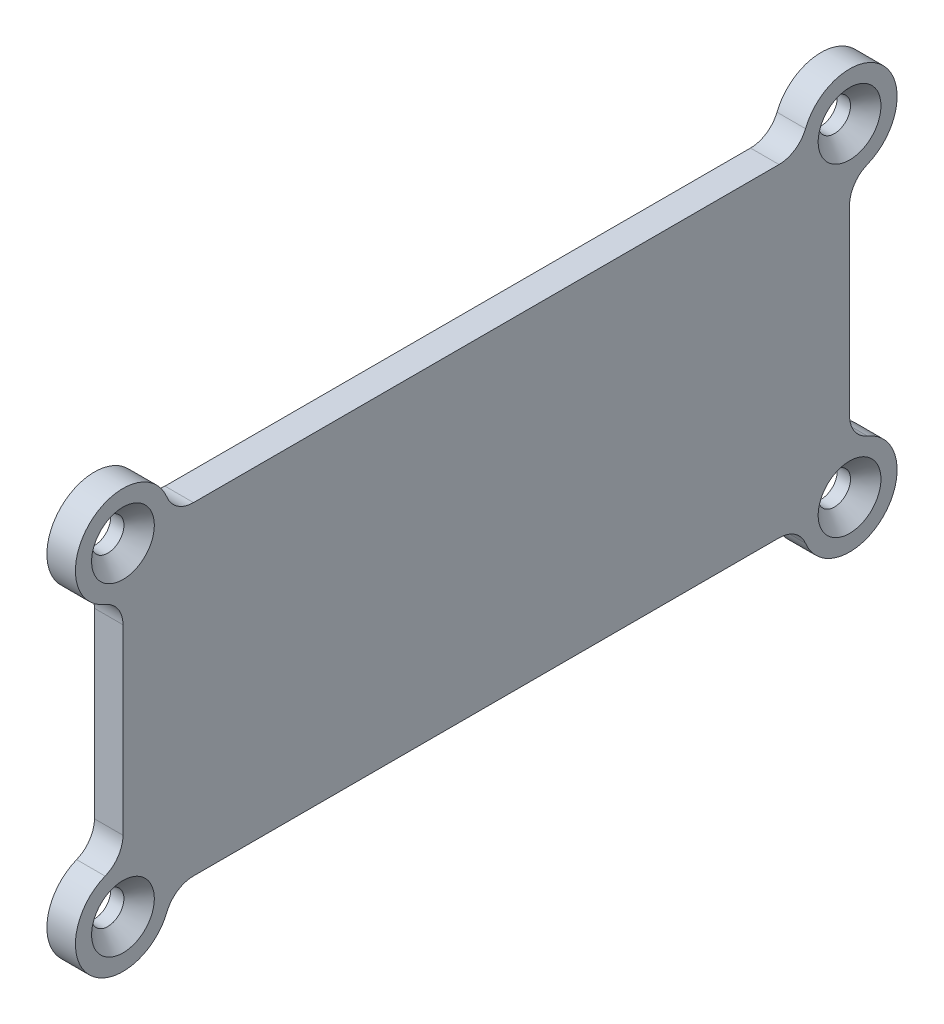
ISO-10303-21;
HEADER;
FILE_DESCRIPTION(('STEP AP214'),'2;1');
FILE_NAME('part.step','',(''),(''),'','','');
FILE_SCHEMA(('AUTOMOTIVE_DESIGN { 1 0 10303 214 1 1 1 1 }'));
ENDSEC;
DATA;
#1=APPLICATION_CONTEXT('core data for automotive mechanical design processes');
#2=APPLICATION_PROTOCOL_DEFINITION('international standard','automotive_design',2000,#1);
#3=PRODUCT_CONTEXT('',#1,'mechanical');
#4=PRODUCT('Part','Part','',(#3));
#5=PRODUCT_RELATED_PRODUCT_CATEGORY('part','',(#4));
#6=PRODUCT_DEFINITION_FORMATION('','',#4);
#7=PRODUCT_DEFINITION_CONTEXT('part definition',#1,'design');
#8=PRODUCT_DEFINITION('design','',#6,#7);
#9=PRODUCT_DEFINITION_SHAPE('','',#8);
#10=(LENGTH_UNIT() NAMED_UNIT(*) SI_UNIT(.MILLI.,.METRE.));
#11=(NAMED_UNIT(*) PLANE_ANGLE_UNIT() SI_UNIT($,.RADIAN.));
#12=(NAMED_UNIT(*) SI_UNIT($,.STERADIAN.) SOLID_ANGLE_UNIT());
#13=UNCERTAINTY_MEASURE_WITH_UNIT(LENGTH_MEASURE(1.E-05),#10,'distance_accuracy_value','');
#14=(GEOMETRIC_REPRESENTATION_CONTEXT(3) GLOBAL_UNCERTAINTY_ASSIGNED_CONTEXT((#13)) GLOBAL_UNIT_ASSIGNED_CONTEXT((#10,
#11,#12)) REPRESENTATION_CONTEXT('',''));
#15=CARTESIAN_POINT('',(0.,0.,0.));
#16=DIRECTION('',(0.,0.,1.));
#17=DIRECTION('',(1.,0.,0.));
#18=AXIS2_PLACEMENT_3D('',#15,#16,#17);
#19=CARTESIAN_POINT('',(3.,17.,38.2));
#20=DIRECTION('',(-1.,0.,0.));
#21=DIRECTION('',(0.,0.,1.));
#22=AXIS2_PLACEMENT_3D('',#19,#20,#21);
#23=CYLINDRICAL_SURFACE('',#22,5.);
#24=CARTESIAN_POINT('',(3.,17.,38.2));
#25=DIRECTION('',(1.,0.,0.));
#26=DIRECTION('',(0.,0.,-1.));
#27=AXIS2_PLACEMENT_3D('',#24,#25,#26);
#28=CIRCLE('',#27,5.);
#29=CARTESIAN_POINT('',(3.,18.875,33.5648759455652));
#30=VERTEX_POINT('',#29);
#31=CARTESIAN_POINT('',(3.,12.3648759455652,40.075));
#32=VERTEX_POINT('',#31);
#33=EDGE_CURVE('E192',#30,#32,#28,.T.);
#34=ORIENTED_EDGE('',*,*,#33,.F.);
#35=DIRECTION('',(-1.,0.,0.));
#36=VECTOR('',#35,1.);
#37=CARTESIAN_POINT('',(3.,18.875,33.5648759455652));
#38=LINE('',#37,#36);
#39=CARTESIAN_POINT('',(0.,18.875,33.5648759455652));
#40=VERTEX_POINT('',#39);
#41=EDGE_CURVE('E215',#30,#40,#38,.T.);
#42=ORIENTED_EDGE('',*,*,#41,.T.);
#43=CARTESIAN_POINT('',(0.,17.,38.2));
#44=DIRECTION('',(1.,0.,0.));
#45=DIRECTION('',(0.,0.,-1.));
#46=AXIS2_PLACEMENT_3D('',#43,#44,#45);
#47=CIRCLE('',#46,5.);
#48=CARTESIAN_POINT('',(0.,12.3648759455652,40.075));
#49=VERTEX_POINT('',#48);
#50=EDGE_CURVE('E252',#40,#49,#47,.T.);
#51=ORIENTED_EDGE('',*,*,#50,.T.);
#52=DIRECTION('',(-1.,0.,0.));
#53=VECTOR('',#52,1.);
#54=CARTESIAN_POINT('',(3.,12.3648759455652,40.075));
#55=LINE('',#54,#53);
#56=EDGE_CURVE('E213',#49,#32,#55,.F.);
#57=ORIENTED_EDGE('',*,*,#56,.T.);
#58=EDGE_LOOP('',(#34,#42,#51,#57));
#59=FACE_BOUND('',#58,.T.);
#60=ADVANCED_FACE('F37',(#59),#23,.T.);
#61=CARTESIAN_POINT('',(3.,12.,38.2));
#62=DIRECTION('',(0.,0.,-1.));
#63=DIRECTION('',(-1.,0.,0.));
#64=AXIS2_PLACEMENT_3D('',#61,#62,#63);
#65=PLANE('',#64);
#66=DIRECTION('',(0.,-1.,0.));
#67=VECTOR('',#66,1.);
#68=CARTESIAN_POINT('',(0.,12.,38.2));
#69=LINE('',#68,#67);
#70=CARTESIAN_POINT('',(0.,9.58380151290434,38.2));
#71=VERTEX_POINT('',#70);
#72=CARTESIAN_POINT('',(0.,-9.58380151290434,38.2));
#73=VERTEX_POINT('',#72);
#74=EDGE_CURVE('E253',#71,#73,#69,.T.);
#75=ORIENTED_EDGE('',*,*,#74,.T.);
#76=DIRECTION('',(1.,0.,0.));
#77=VECTOR('',#76,1.);
#78=CARTESIAN_POINT('',(3.,-9.58380151290434,38.2));
#79=LINE('',#78,#77);
#80=CARTESIAN_POINT('',(3.,-9.58380151290434,38.2));
#81=VERTEX_POINT('',#80);
#82=EDGE_CURVE('E52',#73,#81,#79,.T.);
#83=ORIENTED_EDGE('',*,*,#82,.T.);
#84=DIRECTION('',(0.,-1.,0.));
#85=VECTOR('',#84,1.);
#86=CARTESIAN_POINT('',(3.,12.,38.2));
#87=LINE('',#86,#85);
#88=CARTESIAN_POINT('',(3.,9.58380151290434,38.2));
#89=VERTEX_POINT('',#88);
#90=EDGE_CURVE('E263',#89,#81,#87,.T.);
#91=ORIENTED_EDGE('',*,*,#90,.F.);
#92=DIRECTION('',(1.,0.,0.));
#93=VECTOR('',#92,1.);
#94=CARTESIAN_POINT('',(0.,9.58380151290434,38.2));
#95=LINE('',#94,#93);
#96=EDGE_CURVE('E223',#89,#71,#95,.F.);
#97=ORIENTED_EDGE('',*,*,#96,.T.);
#98=EDGE_LOOP('',(#75,#83,#91,#97));
#99=FACE_BOUND('',#98,.T.);
#100=ADVANCED_FACE('F262',(#99),#65,.F.);
#101=CARTESIAN_POINT('',(3.,-17.,38.2));
#102=DIRECTION('',(-1.,0.,0.));
#103=DIRECTION('',(0.,0.,1.));
#104=AXIS2_PLACEMENT_3D('',#101,#102,#103);
#105=CYLINDRICAL_SURFACE('',#104,5.);
#106=CARTESIAN_POINT('',(0.,-17.,38.2));
#107=DIRECTION('',(1.,0.,0.));
#108=DIRECTION('',(0.,0.,-1.));
#109=AXIS2_PLACEMENT_3D('',#106,#107,#108);
#110=CIRCLE('',#109,5.);
#111=CARTESIAN_POINT('',(0.,-12.3648759455652,40.075));
#112=VERTEX_POINT('',#111);
#113=CARTESIAN_POINT('',(0.,-18.875,33.5648759455652));
#114=VERTEX_POINT('',#113);
#115=EDGE_CURVE('E183',#112,#114,#110,.T.);
#116=ORIENTED_EDGE('',*,*,#115,.T.);
#117=DIRECTION('',(-1.,0.,0.));
#118=VECTOR('',#117,1.);
#119=CARTESIAN_POINT('',(3.,-18.875,33.5648759455652));
#120=LINE('',#119,#118);
#121=CARTESIAN_POINT('',(3.,-18.875,33.5648759455652));
#122=VERTEX_POINT('',#121);
#123=EDGE_CURVE('E221',#114,#122,#120,.F.);
#124=ORIENTED_EDGE('',*,*,#123,.T.);
#125=CARTESIAN_POINT('',(3.,-17.,38.2));
#126=DIRECTION('',(1.,0.,0.));
#127=DIRECTION('',(0.,0.,-1.));
#128=AXIS2_PLACEMENT_3D('',#125,#126,#127);
#129=CIRCLE('',#128,5.);
#130=CARTESIAN_POINT('',(3.,-12.3648759455652,40.075));
#131=VERTEX_POINT('',#130);
#132=EDGE_CURVE('E265',#131,#122,#129,.T.);
#133=ORIENTED_EDGE('',*,*,#132,.F.);
#134=DIRECTION('',(-1.,0.,0.));
#135=VECTOR('',#134,1.);
#136=CARTESIAN_POINT('',(3.,-12.3648759455652,40.075));
#137=LINE('',#136,#135);
#138=EDGE_CURVE('E218',#131,#112,#137,.T.);
#139=ORIENTED_EDGE('',*,*,#138,.T.);
#140=EDGE_LOOP('',(#116,#124,#133,#139));
#141=FACE_BOUND('',#140,.T.);
#142=ADVANCED_FACE('F288',(#141),#105,.T.);
#143=CARTESIAN_POINT('',(3.,-17.,33.2));
#144=DIRECTION('',(0.,1.,0.));
#145=DIRECTION('',(0.,0.,1.));
#146=AXIS2_PLACEMENT_3D('',#143,#144,#145);
#147=PLANE('',#146);
#148=DIRECTION('',(0.,0.,-1.));
#149=VECTOR('',#148,1.);
#150=CARTESIAN_POINT('',(0.,-17.,33.2));
#151=LINE('',#150,#149);
#152=CARTESIAN_POINT('',(0.,-17.,30.7838015129044));
#153=VERTEX_POINT('',#152);
#154=CARTESIAN_POINT('',(0.,-17.,-30.7838015129043));
#155=VERTEX_POINT('',#154);
#156=EDGE_CURVE('E178',#153,#155,#151,.T.);
#157=ORIENTED_EDGE('',*,*,#156,.T.);
#158=DIRECTION('',(1.,0.,0.));
#159=VECTOR('',#158,1.);
#160=CARTESIAN_POINT('',(3.,-17.,-30.7838015129043));
#161=LINE('',#160,#159);
#162=CARTESIAN_POINT('',(3.,-17.,-30.7838015129043));
#163=VERTEX_POINT('',#162);
#164=EDGE_CURVE('E155',#155,#163,#161,.T.);
#165=ORIENTED_EDGE('',*,*,#164,.T.);
#166=DIRECTION('',(0.,0.,-1.));
#167=VECTOR('',#166,1.);
#168=CARTESIAN_POINT('',(3.,-17.,33.2));
#169=LINE('',#168,#167);
#170=CARTESIAN_POINT('',(3.,-17.,30.7838015129044));
#171=VERTEX_POINT('',#170);
#172=EDGE_CURVE('E268',#171,#163,#169,.T.);
#173=ORIENTED_EDGE('',*,*,#172,.F.);
#174=DIRECTION('',(1.,0.,0.));
#175=VECTOR('',#174,1.);
#176=CARTESIAN_POINT('',(0.,-17.,30.7838015129044));
#177=LINE('',#176,#175);
#178=EDGE_CURVE('E170',#171,#153,#177,.F.);
#179=ORIENTED_EDGE('',*,*,#178,.T.);
#180=EDGE_LOOP('',(#157,#165,#173,#179));
#181=FACE_BOUND('',#180,.T.);
#182=ADVANCED_FACE('F298',(#181),#147,.F.);
#183=CARTESIAN_POINT('',(3.,-17.,-38.2));
#184=DIRECTION('',(-1.,0.,0.));
#185=DIRECTION('',(0.,0.,1.));
#186=AXIS2_PLACEMENT_3D('',#183,#184,#185);
#187=CYLINDRICAL_SURFACE('',#186,5.);
#188=CARTESIAN_POINT('',(3.,-17.,-38.2));
#189=DIRECTION('',(1.,0.,0.));
#190=DIRECTION('',(0.,0.,-1.));
#191=AXIS2_PLACEMENT_3D('',#188,#189,#190);
#192=CIRCLE('',#191,5.);
#193=CARTESIAN_POINT('',(3.,-18.875,-33.5648759455652));
#194=VERTEX_POINT('',#193);
#195=CARTESIAN_POINT('',(3.,-12.3648759455652,-40.075));
#196=VERTEX_POINT('',#195);
#197=EDGE_CURVE('E169',#194,#196,#192,.T.);
#198=ORIENTED_EDGE('',*,*,#197,.F.);
#199=DIRECTION('',(-1.,0.,0.));
#200=VECTOR('',#199,1.);
#201=CARTESIAN_POINT('',(3.,-18.875,-33.5648759455652));
#202=LINE('',#201,#200);
#203=CARTESIAN_POINT('',(0.,-18.875,-33.5648759455652));
#204=VERTEX_POINT('',#203);
#205=EDGE_CURVE('E154',#194,#204,#202,.T.);
#206=ORIENTED_EDGE('',*,*,#205,.T.);
#207=CARTESIAN_POINT('',(0.,-17.,-38.2));
#208=DIRECTION('',(1.,0.,0.));
#209=DIRECTION('',(0.,0.,-1.));
#210=AXIS2_PLACEMENT_3D('',#207,#208,#209);
#211=CIRCLE('',#210,5.);
#212=CARTESIAN_POINT('',(0.,-12.3648759455652,-40.075));
#213=VERTEX_POINT('',#212);
#214=EDGE_CURVE('E166',#204,#213,#211,.T.);
#215=ORIENTED_EDGE('',*,*,#214,.T.);
#216=DIRECTION('',(-1.,0.,0.));
#217=VECTOR('',#216,1.);
#218=CARTESIAN_POINT('',(3.,-12.3648759455652,-40.075));
#219=LINE('',#218,#217);
#220=EDGE_CURVE('E171',#213,#196,#219,.F.);
#221=ORIENTED_EDGE('',*,*,#220,.T.);
#222=EDGE_LOOP('',(#198,#206,#215,#221));
#223=FACE_BOUND('',#222,.T.);
#224=ADVANCED_FACE('F165',(#223),#187,.T.);
#225=CARTESIAN_POINT('',(3.,-12.,-38.2));
#226=DIRECTION('',(0.,0.,1.));
#227=DIRECTION('',(1.,0.,0.));
#228=AXIS2_PLACEMENT_3D('',#225,#226,#227);
#229=PLANE('',#228);
#230=DIRECTION('',(0.,1.,0.));
#231=VECTOR('',#230,1.);
#232=CARTESIAN_POINT('',(3.,-12.,-38.2));
#233=LINE('',#232,#231);
#234=CARTESIAN_POINT('',(3.,-9.58380151290434,-38.2));
#235=VERTEX_POINT('',#234);
#236=CARTESIAN_POINT('',(3.,9.58380151290434,-38.2));
#237=VERTEX_POINT('',#236);
#238=EDGE_CURVE('E276',#235,#237,#233,.T.);
#239=ORIENTED_EDGE('',*,*,#238,.F.);
#240=DIRECTION('',(1.,0.,0.));
#241=VECTOR('',#240,1.);
#242=CARTESIAN_POINT('',(0.,-9.58380151290434,-38.2));
#243=LINE('',#242,#241);
#244=CARTESIAN_POINT('',(0.,-9.58380151290434,-38.2));
#245=VERTEX_POINT('',#244);
#246=EDGE_CURVE('E200',#235,#245,#243,.F.);
#247=ORIENTED_EDGE('',*,*,#246,.T.);
#248=DIRECTION('',(0.,1.,0.));
#249=VECTOR('',#248,1.);
#250=CARTESIAN_POINT('',(0.,-12.,-38.2));
#251=LINE('',#250,#249);
#252=CARTESIAN_POINT('',(0.,9.58380151290434,-38.2));
#253=VERTEX_POINT('',#252);
#254=EDGE_CURVE('E177',#245,#253,#251,.T.);
#255=ORIENTED_EDGE('',*,*,#254,.T.);
#256=DIRECTION('',(1.,0.,0.));
#257=VECTOR('',#256,1.);
#258=CARTESIAN_POINT('',(3.,9.58380151290434,-38.2));
#259=LINE('',#258,#257);
#260=EDGE_CURVE('E198',#253,#237,#259,.T.);
#261=ORIENTED_EDGE('',*,*,#260,.T.);
#262=EDGE_LOOP('',(#239,#247,#255,#261));
#263=FACE_BOUND('',#262,.T.);
#264=ADVANCED_FACE('F305',(#263),#229,.F.);
#265=CARTESIAN_POINT('',(3.,17.,-38.2));
#266=DIRECTION('',(-1.,0.,0.));
#267=DIRECTION('',(0.,0.,1.));
#268=AXIS2_PLACEMENT_3D('',#265,#266,#267);
#269=CYLINDRICAL_SURFACE('',#268,5.);
#270=CARTESIAN_POINT('',(3.,17.,-38.2));
#271=DIRECTION('',(1.,0.,0.));
#272=DIRECTION('',(0.,0.,-1.));
#273=AXIS2_PLACEMENT_3D('',#270,#271,#272);
#274=CIRCLE('',#273,5.);
#275=CARTESIAN_POINT('',(3.,12.3648759455652,-40.075));
#276=VERTEX_POINT('',#275);
#277=CARTESIAN_POINT('',(3.,18.875,-33.5648759455652));
#278=VERTEX_POINT('',#277);
#279=EDGE_CURVE('E279',#276,#278,#274,.T.);
#280=ORIENTED_EDGE('',*,*,#279,.F.);
#281=DIRECTION('',(-1.,0.,0.));
#282=VECTOR('',#281,1.);
#283=CARTESIAN_POINT('',(3.,12.3648759455652,-40.075));
#284=LINE('',#283,#282);
#285=CARTESIAN_POINT('',(0.,12.3648759455652,-40.075));
#286=VERTEX_POINT('',#285);
#287=EDGE_CURVE('E205',#276,#286,#284,.T.);
#288=ORIENTED_EDGE('',*,*,#287,.T.);
#289=CARTESIAN_POINT('',(0.,17.,-38.2));
#290=DIRECTION('',(1.,0.,0.));
#291=DIRECTION('',(0.,0.,-1.));
#292=AXIS2_PLACEMENT_3D('',#289,#290,#291);
#293=CIRCLE('',#292,5.);
#294=CARTESIAN_POINT('',(0.,18.875,-33.5648759455652));
#295=VERTEX_POINT('',#294);
#296=EDGE_CURVE('E181',#286,#295,#293,.T.);
#297=ORIENTED_EDGE('',*,*,#296,.T.);
#298=DIRECTION('',(-1.,0.,0.));
#299=VECTOR('',#298,1.);
#300=CARTESIAN_POINT('',(3.,18.875,-33.5648759455652));
#301=LINE('',#300,#299);
#302=EDGE_CURVE('E203',#295,#278,#301,.F.);
#303=ORIENTED_EDGE('',*,*,#302,.T.);
#304=EDGE_LOOP('',(#280,#288,#297,#303));
#305=FACE_BOUND('',#304,.T.);
#306=ADVANCED_FACE('F366',(#305),#269,.T.);
#307=CARTESIAN_POINT('',(3.,17.,-33.2));
#308=DIRECTION('',(0.,-1.,0.));
#309=DIRECTION('',(0.,0.,-1.));
#310=AXIS2_PLACEMENT_3D('',#307,#308,#309);
#311=PLANE('',#310);
#312=DIRECTION('',(0.,0.,1.));
#313=VECTOR('',#312,1.);
#314=CARTESIAN_POINT('',(3.,17.,-33.2));
#315=LINE('',#314,#313);
#316=CARTESIAN_POINT('',(3.,17.,-30.7838015129043));
#317=VERTEX_POINT('',#316);
#318=CARTESIAN_POINT('',(3.,17.,30.7838015129044));
#319=VERTEX_POINT('',#318);
#320=EDGE_CURVE('E193',#317,#319,#315,.T.);
#321=ORIENTED_EDGE('',*,*,#320,.F.);
#322=DIRECTION('',(1.,0.,0.));
#323=VECTOR('',#322,1.);
#324=CARTESIAN_POINT('',(0.,17.,-30.7838015129043));
#325=LINE('',#324,#323);
#326=CARTESIAN_POINT('',(0.,17.,-30.7838015129043));
#327=VERTEX_POINT('',#326);
#328=EDGE_CURVE('E210',#317,#327,#325,.F.);
#329=ORIENTED_EDGE('',*,*,#328,.T.);
#330=DIRECTION('',(0.,0.,1.));
#331=VECTOR('',#330,1.);
#332=CARTESIAN_POINT('',(0.,17.,-33.2));
#333=LINE('',#332,#331);
#334=CARTESIAN_POINT('',(0.,17.,30.7838015129044));
#335=VERTEX_POINT('',#334);
#336=EDGE_CURVE('E189',#327,#335,#333,.T.);
#337=ORIENTED_EDGE('',*,*,#336,.T.);
#338=DIRECTION('',(1.,0.,0.));
#339=VECTOR('',#338,1.);
#340=CARTESIAN_POINT('',(3.,17.,30.7838015129044));
#341=LINE('',#340,#339);
#342=EDGE_CURVE('E208',#335,#319,#341,.T.);
#343=ORIENTED_EDGE('',*,*,#342,.T.);
#344=EDGE_LOOP('',(#321,#329,#337,#343));
#345=FACE_BOUND('',#344,.T.);
#346=ADVANCED_FACE('F359',(#345),#311,.F.);
#347=CARTESIAN_POINT('',(3.,17.,38.2));
#348=DIRECTION('',(1.,0.,0.));
#349=DIRECTION('',(0.,0.,-1.));
#350=AXIS2_PLACEMENT_3D('',#347,#348,#349);
#351=PLANE('',#350);
#352=CARTESIAN_POINT('',(3.,17.,38.2));
#353=DIRECTION('',(1.,0.,0.));
#354=DIRECTION('',(0.,0.,-1.));
#355=AXIS2_PLACEMENT_3D('',#352,#353,#354);
#356=CIRCLE('',#355,3.3);
#357=CARTESIAN_POINT('',(3.,17.,34.9));
#358=VERTEX_POINT('',#357);
#359=EDGE_CURVE('E564',#358,#358,#356,.T.);
#360=ORIENTED_EDGE('',*,*,#359,.F.);
#361=EDGE_LOOP('',(#360));
#362=FACE_BOUND('',#361,.T.);
#363=CARTESIAN_POINT('',(3.,-17.,38.2));
#364=DIRECTION('',(1.,0.,0.));
#365=DIRECTION('',(0.,0.,-1.));
#366=AXIS2_PLACEMENT_3D('',#363,#364,#365);
#367=CIRCLE('',#366,3.3);
#368=CARTESIAN_POINT('',(3.,-17.,34.9));
#369=VERTEX_POINT('',#368);
#370=EDGE_CURVE('E571',#369,#369,#367,.T.);
#371=ORIENTED_EDGE('',*,*,#370,.F.);
#372=EDGE_LOOP('',(#371));
#373=FACE_BOUND('',#372,.T.);
#374=CARTESIAN_POINT('',(3.,-17.,-38.2));
#375=DIRECTION('',(1.,0.,0.));
#376=DIRECTION('',(0.,0.,-1.));
#377=AXIS2_PLACEMENT_3D('',#374,#375,#376);
#378=CIRCLE('',#377,3.3);
#379=CARTESIAN_POINT('',(3.,-17.,-41.5));
#380=VERTEX_POINT('',#379);
#381=EDGE_CURVE('E580',#380,#380,#378,.T.);
#382=ORIENTED_EDGE('',*,*,#381,.F.);
#383=EDGE_LOOP('',(#382));
#384=FACE_BOUND('',#383,.T.);
#385=CARTESIAN_POINT('',(3.,17.,-38.2));
#386=DIRECTION('',(1.,0.,0.));
#387=DIRECTION('',(0.,0.,-1.));
#388=AXIS2_PLACEMENT_3D('',#385,#386,#387);
#389=CIRCLE('',#388,3.3);
#390=CARTESIAN_POINT('',(3.,17.,-41.5));
#391=VERTEX_POINT('',#390);
#392=EDGE_CURVE('E589',#391,#391,#389,.T.);
#393=ORIENTED_EDGE('',*,*,#392,.F.);
#394=EDGE_LOOP('',(#393));
#395=FACE_BOUND('',#394,.T.);
#396=ORIENTED_EDGE('',*,*,#320,.T.);
#397=CARTESIAN_POINT('',(3.,20.,30.7838015129044));
#398=DIRECTION('',(1.,0.,0.));
#399=DIRECTION('',(0.,0.,-1.));
#400=AXIS2_PLACEMENT_3D('',#397,#398,#399);
#401=CIRCLE('',#400,3.);
#402=EDGE_CURVE('E241',#319,#30,#401,.F.);
#403=ORIENTED_EDGE('',*,*,#402,.T.);
#404=ORIENTED_EDGE('',*,*,#33,.T.);
#405=CARTESIAN_POINT('',(3.,9.58380151290434,41.2));
#406=DIRECTION('',(1.,0.,0.));
#407=DIRECTION('',(0.,0.,-1.));
#408=AXIS2_PLACEMENT_3D('',#405,#406,#407);
#409=CIRCLE('',#408,3.);
#410=EDGE_CURVE('E11',#32,#89,#409,.F.);
#411=ORIENTED_EDGE('',*,*,#410,.T.);
#412=ORIENTED_EDGE('',*,*,#90,.T.);
#413=CARTESIAN_POINT('',(3.,-9.58380151290434,41.2));
#414=DIRECTION('',(1.,0.,0.));
#415=DIRECTION('',(0.,0.,-1.));
#416=AXIS2_PLACEMENT_3D('',#413,#414,#415);
#417=CIRCLE('',#416,3.);
#418=EDGE_CURVE('E249',#81,#131,#417,.F.);
#419=ORIENTED_EDGE('',*,*,#418,.T.);
#420=ORIENTED_EDGE('',*,*,#132,.T.);
#421=CARTESIAN_POINT('',(3.,-20.,30.7838015129044));
#422=DIRECTION('',(1.,0.,0.));
#423=DIRECTION('',(0.,0.,-1.));
#424=AXIS2_PLACEMENT_3D('',#421,#422,#423);
#425=CIRCLE('',#424,3.);
#426=EDGE_CURVE('E245',#122,#171,#425,.F.);
#427=ORIENTED_EDGE('',*,*,#426,.T.);
#428=ORIENTED_EDGE('',*,*,#172,.T.);
#429=CARTESIAN_POINT('',(3.,-20.,-30.7838015129043));
#430=DIRECTION('',(1.,0.,0.));
#431=DIRECTION('',(0.,0.,-1.));
#432=AXIS2_PLACEMENT_3D('',#429,#430,#431);
#433=CIRCLE('',#432,3.);
#434=EDGE_CURVE('E160',#163,#194,#433,.F.);
#435=ORIENTED_EDGE('',*,*,#434,.T.);
#436=ORIENTED_EDGE('',*,*,#197,.T.);
#437=CARTESIAN_POINT('',(3.,-9.58380151290434,-41.2));
#438=DIRECTION('',(1.,0.,0.));
#439=DIRECTION('',(0.,0.,-1.));
#440=AXIS2_PLACEMENT_3D('',#437,#438,#439);
#441=CIRCLE('',#440,3.);
#442=EDGE_CURVE('E229',#196,#235,#441,.F.);
#443=ORIENTED_EDGE('',*,*,#442,.T.);
#444=ORIENTED_EDGE('',*,*,#238,.T.);
#445=CARTESIAN_POINT('',(3.,9.58380151290434,-41.2));
#446=DIRECTION('',(1.,0.,0.));
#447=DIRECTION('',(0.,0.,-1.));
#448=AXIS2_PLACEMENT_3D('',#445,#446,#447);
#449=CIRCLE('',#448,3.);
#450=EDGE_CURVE('E233',#237,#276,#449,.F.);
#451=ORIENTED_EDGE('',*,*,#450,.T.);
#452=ORIENTED_EDGE('',*,*,#279,.T.);
#453=CARTESIAN_POINT('',(3.,20.,-30.7838015129043));
#454=DIRECTION('',(1.,0.,0.));
#455=DIRECTION('',(0.,0.,-1.));
#456=AXIS2_PLACEMENT_3D('',#453,#454,#455);
#457=CIRCLE('',#456,3.);
#458=EDGE_CURVE('E237',#278,#317,#457,.F.);
#459=ORIENTED_EDGE('',*,*,#458,.T.);
#460=EDGE_LOOP('',(#396,#403,#404,#411,#412,#419,#420,#427,#428,#435,#436,#443,#444,#451,#452,#459));
#461=FACE_BOUND('',#460,.T.);
#462=ADVANCED_FACE('F296',(#362,#373,#384,#395,#461),#351,.T.);
#463=CARTESIAN_POINT('',(0.,17.,38.2));
#464=DIRECTION('',(1.,0.,0.));
#465=DIRECTION('',(0.,0.,-1.));
#466=AXIS2_PLACEMENT_3D('',#463,#464,#465);
#467=PLANE('',#466);
#468=CARTESIAN_POINT('',(0.,17.,38.2));
#469=DIRECTION('',(1.,0.,0.));
#470=DIRECTION('',(0.,0.,-1.));
#471=AXIS2_PLACEMENT_3D('',#468,#469,#470);
#472=CIRCLE('',#471,1.7);
#473=CARTESIAN_POINT('',(0.,17.,36.5));
#474=VERTEX_POINT('',#473);
#475=EDGE_CURVE('E566',#474,#474,#472,.T.);
#476=ORIENTED_EDGE('',*,*,#475,.T.);
#477=EDGE_LOOP('',(#476));
#478=FACE_BOUND('',#477,.T.);
#479=CARTESIAN_POINT('',(0.,-17.,38.2));
#480=DIRECTION('',(1.,0.,0.));
#481=DIRECTION('',(0.,0.,-1.));
#482=AXIS2_PLACEMENT_3D('',#479,#480,#481);
#483=CIRCLE('',#482,1.7);
#484=CARTESIAN_POINT('',(0.,-17.,36.5));
#485=VERTEX_POINT('',#484);
#486=EDGE_CURVE('E577',#485,#485,#483,.T.);
#487=ORIENTED_EDGE('',*,*,#486,.T.);
#488=EDGE_LOOP('',(#487));
#489=FACE_BOUND('',#488,.T.);
#490=CARTESIAN_POINT('',(0.,-17.,-38.2));
#491=DIRECTION('',(1.,0.,0.));
#492=DIRECTION('',(0.,0.,-1.));
#493=AXIS2_PLACEMENT_3D('',#490,#491,#492);
#494=CIRCLE('',#493,1.7);
#495=CARTESIAN_POINT('',(0.,-17.,-39.9));
#496=VERTEX_POINT('',#495);
#497=EDGE_CURVE('E586',#496,#496,#494,.T.);
#498=ORIENTED_EDGE('',*,*,#497,.T.);
#499=EDGE_LOOP('',(#498));
#500=FACE_BOUND('',#499,.T.);
#501=CARTESIAN_POINT('',(0.,17.,-38.2));
#502=DIRECTION('',(1.,0.,0.));
#503=DIRECTION('',(0.,0.,-1.));
#504=AXIS2_PLACEMENT_3D('',#501,#502,#503);
#505=CIRCLE('',#504,1.7);
#506=CARTESIAN_POINT('',(0.,17.,-39.9));
#507=VERTEX_POINT('',#506);
#508=EDGE_CURVE('E260',#507,#507,#505,.T.);
#509=ORIENTED_EDGE('',*,*,#508,.T.);
#510=EDGE_LOOP('',(#509));
#511=FACE_BOUND('',#510,.T.);
#512=ORIENTED_EDGE('',*,*,#50,.F.);
#513=CARTESIAN_POINT('',(0.,20.,30.7838015129044));
#514=DIRECTION('',(1.,0.,0.));
#515=DIRECTION('',(0.,0.,-1.));
#516=AXIS2_PLACEMENT_3D('',#513,#514,#515);
#517=CIRCLE('',#516,3.);
#518=EDGE_CURVE('E239',#40,#335,#517,.T.);
#519=ORIENTED_EDGE('',*,*,#518,.T.);
#520=ORIENTED_EDGE('',*,*,#336,.F.);
#521=CARTESIAN_POINT('',(0.,20.,-30.7838015129043));
#522=DIRECTION('',(1.,0.,0.));
#523=DIRECTION('',(0.,0.,-1.));
#524=AXIS2_PLACEMENT_3D('',#521,#522,#523);
#525=CIRCLE('',#524,3.);
#526=EDGE_CURVE('E235',#327,#295,#525,.T.);
#527=ORIENTED_EDGE('',*,*,#526,.T.);
#528=ORIENTED_EDGE('',*,*,#296,.F.);
#529=CARTESIAN_POINT('',(0.,9.58380151290434,-41.2));
#530=DIRECTION('',(1.,0.,0.));
#531=DIRECTION('',(0.,0.,-1.));
#532=AXIS2_PLACEMENT_3D('',#529,#530,#531);
#533=CIRCLE('',#532,3.);
#534=EDGE_CURVE('E231',#286,#253,#533,.T.);
#535=ORIENTED_EDGE('',*,*,#534,.T.);
#536=ORIENTED_EDGE('',*,*,#254,.F.);
#537=CARTESIAN_POINT('',(0.,-9.58380151290434,-41.2));
#538=DIRECTION('',(1.,0.,0.));
#539=DIRECTION('',(0.,0.,-1.));
#540=AXIS2_PLACEMENT_3D('',#537,#538,#539);
#541=CIRCLE('',#540,3.);
#542=EDGE_CURVE('E176',#245,#213,#541,.T.);
#543=ORIENTED_EDGE('',*,*,#542,.T.);
#544=ORIENTED_EDGE('',*,*,#214,.F.);
#545=CARTESIAN_POINT('',(0.,-20.,-30.7838015129043));
#546=DIRECTION('',(1.,0.,0.));
#547=DIRECTION('',(0.,0.,-1.));
#548=AXIS2_PLACEMENT_3D('',#545,#546,#547);
#549=CIRCLE('',#548,3.);
#550=EDGE_CURVE('E150',#204,#155,#549,.T.);
#551=ORIENTED_EDGE('',*,*,#550,.T.);
#552=ORIENTED_EDGE('',*,*,#156,.F.);
#553=CARTESIAN_POINT('',(0.,-20.,30.7838015129044));
#554=DIRECTION('',(1.,0.,0.));
#555=DIRECTION('',(0.,0.,-1.));
#556=AXIS2_PLACEMENT_3D('',#553,#554,#555);
#557=CIRCLE('',#556,3.);
#558=EDGE_CURVE('E243',#153,#114,#557,.T.);
#559=ORIENTED_EDGE('',*,*,#558,.T.);
#560=ORIENTED_EDGE('',*,*,#115,.F.);
#561=CARTESIAN_POINT('',(0.,-9.58380151290434,41.2));
#562=DIRECTION('',(1.,0.,0.));
#563=DIRECTION('',(0.,0.,-1.));
#564=AXIS2_PLACEMENT_3D('',#561,#562,#563);
#565=CIRCLE('',#564,3.);
#566=EDGE_CURVE('E247',#112,#73,#565,.T.);
#567=ORIENTED_EDGE('',*,*,#566,.T.);
#568=ORIENTED_EDGE('',*,*,#74,.F.);
#569=CARTESIAN_POINT('',(0.,9.58380151290434,41.2));
#570=DIRECTION('',(1.,0.,0.));
#571=DIRECTION('',(0.,0.,-1.));
#572=AXIS2_PLACEMENT_3D('',#569,#570,#571);
#573=CIRCLE('',#572,3.);
#574=EDGE_CURVE('E45',#71,#49,#573,.T.);
#575=ORIENTED_EDGE('',*,*,#574,.T.);
#576=EDGE_LOOP('',(#512,#519,#520,#527,#528,#535,#536,#543,#544,#551,#552,#559,#560,#567,#568,#575));
#577=FACE_BOUND('',#576,.T.);
#578=ADVANCED_FACE('F174',(#478,#489,#500,#511,#577),#467,.F.);
#579=CARTESIAN_POINT('',(3.,-20.,-30.7838015129043));
#580=DIRECTION('',(-1.,0.,0.));
#581=DIRECTION('',(0.,0.,1.));
#582=AXIS2_PLACEMENT_3D('',#579,#580,#581);
#583=CYLINDRICAL_SURFACE('',#582,3.);
#584=ORIENTED_EDGE('',*,*,#434,.F.);
#585=ORIENTED_EDGE('',*,*,#164,.F.);
#586=ORIENTED_EDGE('',*,*,#550,.F.);
#587=ORIENTED_EDGE('',*,*,#205,.F.);
#588=EDGE_LOOP('',(#584,#585,#586,#587));
#589=FACE_BOUND('',#588,.T.);
#590=ADVANCED_FACE('F153',(#589),#583,.F.);
#591=CARTESIAN_POINT('',(3.,-9.58380151290434,-41.2));
#592=DIRECTION('',(-1.,0.,0.));
#593=DIRECTION('',(0.,0.,1.));
#594=AXIS2_PLACEMENT_3D('',#591,#592,#593);
#595=CYLINDRICAL_SURFACE('',#594,3.);
#596=ORIENTED_EDGE('',*,*,#442,.F.);
#597=ORIENTED_EDGE('',*,*,#220,.F.);
#598=ORIENTED_EDGE('',*,*,#542,.F.);
#599=ORIENTED_EDGE('',*,*,#246,.F.);
#600=EDGE_LOOP('',(#596,#597,#598,#599));
#601=FACE_BOUND('',#600,.T.);
#602=ADVANCED_FACE('F317',(#601),#595,.F.);
#603=CARTESIAN_POINT('',(3.,9.58380151290434,-41.2));
#604=DIRECTION('',(-1.,0.,0.));
#605=DIRECTION('',(0.,0.,1.));
#606=AXIS2_PLACEMENT_3D('',#603,#604,#605);
#607=CYLINDRICAL_SURFACE('',#606,3.);
#608=ORIENTED_EDGE('',*,*,#450,.F.);
#609=ORIENTED_EDGE('',*,*,#260,.F.);
#610=ORIENTED_EDGE('',*,*,#534,.F.);
#611=ORIENTED_EDGE('',*,*,#287,.F.);
#612=EDGE_LOOP('',(#608,#609,#610,#611));
#613=FACE_BOUND('',#612,.T.);
#614=ADVANCED_FACE('F320',(#613),#607,.F.);
#615=CARTESIAN_POINT('',(3.,20.,-30.7838015129043));
#616=DIRECTION('',(-1.,0.,0.));
#617=DIRECTION('',(0.,0.,1.));
#618=AXIS2_PLACEMENT_3D('',#615,#616,#617);
#619=CYLINDRICAL_SURFACE('',#618,3.);
#620=ORIENTED_EDGE('',*,*,#458,.F.);
#621=ORIENTED_EDGE('',*,*,#302,.F.);
#622=ORIENTED_EDGE('',*,*,#526,.F.);
#623=ORIENTED_EDGE('',*,*,#328,.F.);
#624=EDGE_LOOP('',(#620,#621,#622,#623));
#625=FACE_BOUND('',#624,.T.);
#626=ADVANCED_FACE('F324',(#625),#619,.F.);
#627=CARTESIAN_POINT('',(3.,20.,30.7838015129044));
#628=DIRECTION('',(-1.,0.,0.));
#629=DIRECTION('',(0.,0.,1.));
#630=AXIS2_PLACEMENT_3D('',#627,#628,#629);
#631=CYLINDRICAL_SURFACE('',#630,3.);
#632=ORIENTED_EDGE('',*,*,#402,.F.);
#633=ORIENTED_EDGE('',*,*,#342,.F.);
#634=ORIENTED_EDGE('',*,*,#518,.F.);
#635=ORIENTED_EDGE('',*,*,#41,.F.);
#636=EDGE_LOOP('',(#632,#633,#634,#635));
#637=FACE_BOUND('',#636,.T.);
#638=ADVANCED_FACE('F328',(#637),#631,.F.);
#639=CARTESIAN_POINT('',(3.,-20.,30.7838015129044));
#640=DIRECTION('',(-1.,0.,0.));
#641=DIRECTION('',(0.,0.,1.));
#642=AXIS2_PLACEMENT_3D('',#639,#640,#641);
#643=CYLINDRICAL_SURFACE('',#642,3.);
#644=ORIENTED_EDGE('',*,*,#426,.F.);
#645=ORIENTED_EDGE('',*,*,#123,.F.);
#646=ORIENTED_EDGE('',*,*,#558,.F.);
#647=ORIENTED_EDGE('',*,*,#178,.F.);
#648=EDGE_LOOP('',(#644,#645,#646,#647));
#649=FACE_BOUND('',#648,.T.);
#650=ADVANCED_FACE('F293',(#649),#643,.F.);
#651=CARTESIAN_POINT('',(3.,-9.58380151290434,41.2));
#652=DIRECTION('',(-1.,0.,0.));
#653=DIRECTION('',(0.,0.,1.));
#654=AXIS2_PLACEMENT_3D('',#651,#652,#653);
#655=CYLINDRICAL_SURFACE('',#654,3.);
#656=ORIENTED_EDGE('',*,*,#418,.F.);
#657=ORIENTED_EDGE('',*,*,#82,.F.);
#658=ORIENTED_EDGE('',*,*,#566,.F.);
#659=ORIENTED_EDGE('',*,*,#138,.F.);
#660=EDGE_LOOP('',(#656,#657,#658,#659));
#661=FACE_BOUND('',#660,.T.);
#662=ADVANCED_FACE('F334',(#661),#655,.F.);
#663=CARTESIAN_POINT('',(3.,9.58380151290434,41.2));
#664=DIRECTION('',(-1.,0.,0.));
#665=DIRECTION('',(0.,0.,1.));
#666=AXIS2_PLACEMENT_3D('',#663,#664,#665);
#667=CYLINDRICAL_SURFACE('',#666,3.);
#668=ORIENTED_EDGE('',*,*,#410,.F.);
#669=ORIENTED_EDGE('',*,*,#56,.F.);
#670=ORIENTED_EDGE('',*,*,#574,.F.);
#671=ORIENTED_EDGE('',*,*,#96,.F.);
#672=EDGE_LOOP('',(#668,#669,#670,#671));
#673=FACE_BOUND('',#672,.T.);
#674=ADVANCED_FACE('F39',(#673),#667,.F.);
#675=CARTESIAN_POINT('',(3.,17.,-38.2));
#676=DIRECTION('',(1.,0.,0.));
#677=DIRECTION('',(0.,0.,-1.));
#678=AXIS2_PLACEMENT_3D('',#675,#676,#677);
#679=CYLINDRICAL_SURFACE('',#678,1.7);
#680=ORIENTED_EDGE('',*,*,#508,.F.);
#681=EDGE_LOOP('',(#680));
#682=FACE_BOUND('',#681,.T.);
#683=CARTESIAN_POINT('',(1.4,17.,-38.2));
#684=DIRECTION('',(1.,0.,0.));
#685=DIRECTION('',(0.,0.,-1.));
#686=AXIS2_PLACEMENT_3D('',#683,#684,#685);
#687=CIRCLE('',#686,1.7);
#688=CARTESIAN_POINT('',(1.4,17.,-39.9));
#689=VERTEX_POINT('',#688);
#690=EDGE_CURVE('E592',#689,#689,#687,.T.);
#691=ORIENTED_EDGE('',*,*,#690,.T.);
#692=EDGE_LOOP('',(#691));
#693=FACE_BOUND('',#692,.T.);
#694=ADVANCED_FACE('F340',(#682,#693),#679,.F.);
#695=CARTESIAN_POINT('',(3.,17.,-38.2));
#696=DIRECTION('',(1.,0.,0.));
#697=DIRECTION('',(0.,0.,-1.));
#698=AXIS2_PLACEMENT_3D('',#695,#696,#697);
#699=CONICAL_SURFACE('',#698,3.3,0.785398163397449);
#700=ORIENTED_EDGE('',*,*,#690,.F.);
#701=EDGE_LOOP('',(#700));
#702=FACE_BOUND('',#701,.T.);
#703=ORIENTED_EDGE('',*,*,#392,.T.);
#704=EDGE_LOOP('',(#703));
#705=FACE_BOUND('',#704,.T.);
#706=ADVANCED_FACE('F344',(#702,#705),#699,.F.);
#707=CARTESIAN_POINT('',(3.,-17.,-38.2));
#708=DIRECTION('',(1.,0.,0.));
#709=DIRECTION('',(0.,0.,-1.));
#710=AXIS2_PLACEMENT_3D('',#707,#708,#709);
#711=CYLINDRICAL_SURFACE('',#710,1.7);
#712=ORIENTED_EDGE('',*,*,#497,.F.);
#713=EDGE_LOOP('',(#712));
#714=FACE_BOUND('',#713,.T.);
#715=CARTESIAN_POINT('',(1.4,-17.,-38.2));
#716=DIRECTION('',(1.,0.,0.));
#717=DIRECTION('',(0.,0.,-1.));
#718=AXIS2_PLACEMENT_3D('',#715,#716,#717);
#719=CIRCLE('',#718,1.7);
#720=CARTESIAN_POINT('',(1.4,-17.,-39.9));
#721=VERTEX_POINT('',#720);
#722=EDGE_CURVE('E583',#721,#721,#719,.T.);
#723=ORIENTED_EDGE('',*,*,#722,.T.);
#724=EDGE_LOOP('',(#723));
#725=FACE_BOUND('',#724,.T.);
#726=ADVANCED_FACE('F350',(#714,#725),#711,.F.);
#727=CARTESIAN_POINT('',(3.,-17.,-38.2));
#728=DIRECTION('',(1.,0.,0.));
#729=DIRECTION('',(0.,0.,-1.));
#730=AXIS2_PLACEMENT_3D('',#727,#728,#729);
#731=CONICAL_SURFACE('',#730,3.3,0.785398163397449);
#732=ORIENTED_EDGE('',*,*,#722,.F.);
#733=EDGE_LOOP('',(#732));
#734=FACE_BOUND('',#733,.T.);
#735=ORIENTED_EDGE('',*,*,#381,.T.);
#736=EDGE_LOOP('',(#735));
#737=FACE_BOUND('',#736,.T.);
#738=ADVANCED_FACE('F505',(#734,#737),#731,.F.);
#739=CARTESIAN_POINT('',(3.,-17.,38.2));
#740=DIRECTION('',(1.,0.,0.));
#741=DIRECTION('',(0.,0.,-1.));
#742=AXIS2_PLACEMENT_3D('',#739,#740,#741);
#743=CYLINDRICAL_SURFACE('',#742,1.7);
#744=ORIENTED_EDGE('',*,*,#486,.F.);
#745=EDGE_LOOP('',(#744));
#746=FACE_BOUND('',#745,.T.);
#747=CARTESIAN_POINT('',(1.4,-17.,38.2));
#748=DIRECTION('',(1.,0.,0.));
#749=DIRECTION('',(0.,0.,-1.));
#750=AXIS2_PLACEMENT_3D('',#747,#748,#749);
#751=CIRCLE('',#750,1.7);
#752=CARTESIAN_POINT('',(1.4,-17.,36.5));
#753=VERTEX_POINT('',#752);
#754=EDGE_CURVE('E574',#753,#753,#751,.T.);
#755=ORIENTED_EDGE('',*,*,#754,.T.);
#756=EDGE_LOOP('',(#755));
#757=FACE_BOUND('',#756,.T.);
#758=ADVANCED_FACE('F513',(#746,#757),#743,.F.);
#759=CARTESIAN_POINT('',(3.,-17.,38.2));
#760=DIRECTION('',(1.,0.,0.));
#761=DIRECTION('',(0.,0.,-1.));
#762=AXIS2_PLACEMENT_3D('',#759,#760,#761);
#763=CONICAL_SURFACE('',#762,3.3,0.785398163397449);
#764=ORIENTED_EDGE('',*,*,#754,.F.);
#765=EDGE_LOOP('',(#764));
#766=FACE_BOUND('',#765,.T.);
#767=ORIENTED_EDGE('',*,*,#370,.T.);
#768=EDGE_LOOP('',(#767));
#769=FACE_BOUND('',#768,.T.);
#770=ADVANCED_FACE('F522',(#766,#769),#763,.F.);
#771=CARTESIAN_POINT('',(3.,17.,38.2));
#772=DIRECTION('',(1.,0.,0.));
#773=DIRECTION('',(0.,0.,-1.));
#774=AXIS2_PLACEMENT_3D('',#771,#772,#773);
#775=CYLINDRICAL_SURFACE('',#774,1.7);
#776=ORIENTED_EDGE('',*,*,#475,.F.);
#777=EDGE_LOOP('',(#776));
#778=FACE_BOUND('',#777,.T.);
#779=CARTESIAN_POINT('',(1.4,17.,38.2));
#780=DIRECTION('',(1.,0.,0.));
#781=DIRECTION('',(0.,0.,-1.));
#782=AXIS2_PLACEMENT_3D('',#779,#780,#781);
#783=CIRCLE('',#782,1.7);
#784=CARTESIAN_POINT('',(1.4,17.,36.5));
#785=VERTEX_POINT('',#784);
#786=EDGE_CURVE('E561',#785,#785,#783,.T.);
#787=ORIENTED_EDGE('',*,*,#786,.T.);
#788=EDGE_LOOP('',(#787));
#789=FACE_BOUND('',#788,.T.);
#790=ADVANCED_FACE('F531',(#778,#789),#775,.F.);
#791=CARTESIAN_POINT('',(3.,17.,38.2));
#792=DIRECTION('',(1.,0.,0.));
#793=DIRECTION('',(0.,0.,-1.));
#794=AXIS2_PLACEMENT_3D('',#791,#792,#793);
#795=CONICAL_SURFACE('',#794,3.3,0.785398163397449);
#796=ORIENTED_EDGE('',*,*,#786,.F.);
#797=EDGE_LOOP('',(#796));
#798=FACE_BOUND('',#797,.T.);
#799=ORIENTED_EDGE('',*,*,#359,.T.);
#800=EDGE_LOOP('',(#799));
#801=FACE_BOUND('',#800,.T.);
#802=ADVANCED_FACE('F540',(#798,#801),#795,.F.);
#803=CLOSED_SHELL('',(#60,#100,#142,#182,#224,#264,#306,#346,#462,#578,#590,#602,#614,#626,#638,
#650,#662,#674,#694,#706,#726,#738,#758,#770,#790,#802));
#804=MANIFOLD_SOLID_BREP('B2',#803);
#805=ADVANCED_BREP_SHAPE_REPRESENTATION('',(#18,#804),#14);
#806=SHAPE_DEFINITION_REPRESENTATION(#9,#805);
ENDSEC;
END-ISO-10303-21;
